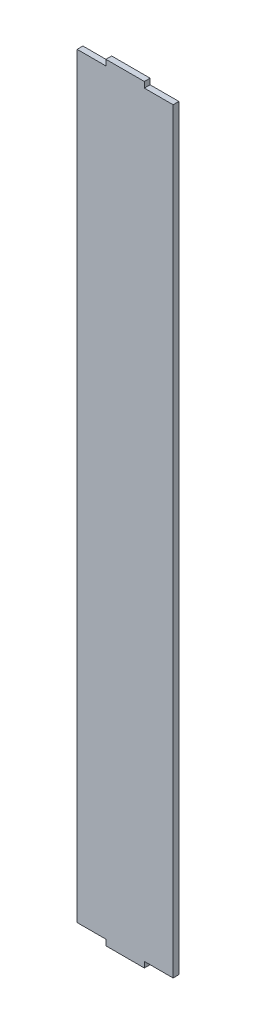
ISO-10303-21;
HEADER;
FILE_DESCRIPTION(('STEP AP214'),'2;1');
FILE_NAME('part.step','',(''),(''),'','','');
FILE_SCHEMA(('AUTOMOTIVE_DESIGN { 1 0 10303 214 1 1 1 1 }'));
ENDSEC;
DATA;
#1=APPLICATION_CONTEXT('core data for automotive mechanical design processes');
#2=APPLICATION_PROTOCOL_DEFINITION('international standard','automotive_design',2000,#1);
#3=PRODUCT_CONTEXT('',#1,'mechanical');
#4=PRODUCT('Part','Part','',(#3));
#5=PRODUCT_RELATED_PRODUCT_CATEGORY('part','',(#4));
#6=PRODUCT_DEFINITION_FORMATION('','',#4);
#7=PRODUCT_DEFINITION_CONTEXT('part definition',#1,'design');
#8=PRODUCT_DEFINITION('design','',#6,#7);
#9=PRODUCT_DEFINITION_SHAPE('','',#8);
#10=(LENGTH_UNIT() NAMED_UNIT(*) SI_UNIT(.MILLI.,.METRE.));
#11=(NAMED_UNIT(*) PLANE_ANGLE_UNIT() SI_UNIT($,.RADIAN.));
#12=(NAMED_UNIT(*) SI_UNIT($,.STERADIAN.) SOLID_ANGLE_UNIT());
#13=UNCERTAINTY_MEASURE_WITH_UNIT(LENGTH_MEASURE(1.E-05),#10,'distance_accuracy_value','');
#14=(GEOMETRIC_REPRESENTATION_CONTEXT(3) GLOBAL_UNCERTAINTY_ASSIGNED_CONTEXT((#13)) GLOBAL_UNIT_ASSIGNED_CONTEXT((#10,
#11,#12)) REPRESENTATION_CONTEXT('',''));
#15=CARTESIAN_POINT('',(0.,0.,0.));
#16=DIRECTION('',(0.,0.,1.));
#17=DIRECTION('',(1.,0.,0.));
#18=AXIS2_PLACEMENT_3D('',#15,#16,#17);
#19=CARTESIAN_POINT('',(35.,0.,3.));
#20=DIRECTION('',(-1.,0.,0.));
#21=DIRECTION('',(0.,0.,1.));
#22=AXIS2_PLACEMENT_3D('',#19,#20,#21);
#23=PLANE('',#22);
#24=DIRECTION('',(0.,1.,0.));
#25=VECTOR('',#24,1.);
#26=CARTESIAN_POINT('',(35.,0.,0.));
#27=LINE('',#26,#25);
#28=CARTESIAN_POINT('',(35.,-3.,0.));
#29=VERTEX_POINT('',#28);
#30=CARTESIAN_POINT('',(35.,0.,0.));
#31=VERTEX_POINT('',#30);
#32=EDGE_CURVE('E154',#29,#31,#27,.T.);
#33=ORIENTED_EDGE('',*,*,#32,.T.);
#34=DIRECTION('',(0.,0.,-1.));
#35=VECTOR('',#34,1.);
#36=CARTESIAN_POINT('',(35.,0.,3.));
#37=LINE('',#36,#35);
#38=CARTESIAN_POINT('',(35.,0.,3.));
#39=VERTEX_POINT('',#38);
#40=EDGE_CURVE('E11',#39,#31,#37,.T.);
#41=ORIENTED_EDGE('',*,*,#40,.F.);
#42=DIRECTION('',(0.,1.,0.));
#43=VECTOR('',#42,1.);
#44=CARTESIAN_POINT('',(35.,0.,3.));
#45=LINE('',#44,#43);
#46=CARTESIAN_POINT('',(35.,-3.,3.));
#47=VERTEX_POINT('',#46);
#48=EDGE_CURVE('E181',#47,#39,#45,.T.);
#49=ORIENTED_EDGE('',*,*,#48,.F.);
#50=DIRECTION('',(0.,0.,-1.));
#51=VECTOR('',#50,1.);
#52=CARTESIAN_POINT('',(35.,-3.,3.));
#53=LINE('',#52,#51);
#54=EDGE_CURVE('E150',#47,#29,#53,.T.);
#55=ORIENTED_EDGE('',*,*,#54,.T.);
#56=EDGE_LOOP('',(#33,#41,#49,#55));
#57=FACE_BOUND('',#56,.T.);
#58=ADVANCED_FACE('F33',(#57),#23,.F.);
#59=CARTESIAN_POINT('',(0.,0.,3.));
#60=DIRECTION('',(0.,1.,0.));
#61=DIRECTION('',(0.,0.,1.));
#62=AXIS2_PLACEMENT_3D('',#59,#60,#61);
#63=PLANE('',#62);
#64=DIRECTION('',(1.,0.,0.));
#65=VECTOR('',#64,1.);
#66=CARTESIAN_POINT('',(0.,0.,0.));
#67=LINE('',#66,#65);
#68=CARTESIAN_POINT('',(50.,0.,0.));
#69=VERTEX_POINT('',#68);
#70=EDGE_CURVE('E157',#31,#69,#67,.T.);
#71=ORIENTED_EDGE('',*,*,#70,.T.);
#72=DIRECTION('',(0.,0.,-1.));
#73=VECTOR('',#72,1.);
#74=CARTESIAN_POINT('',(50.,0.,3.));
#75=LINE('',#74,#73);
#76=CARTESIAN_POINT('',(50.,0.,3.));
#77=VERTEX_POINT('',#76);
#78=EDGE_CURVE('E41',#77,#69,#75,.T.);
#79=ORIENTED_EDGE('',*,*,#78,.F.);
#80=DIRECTION('',(1.,0.,0.));
#81=VECTOR('',#80,1.);
#82=CARTESIAN_POINT('',(0.,0.,3.));
#83=LINE('',#82,#81);
#84=EDGE_CURVE('E104',#39,#77,#83,.T.);
#85=ORIENTED_EDGE('',*,*,#84,.F.);
#86=ORIENTED_EDGE('',*,*,#40,.T.);
#87=EDGE_LOOP('',(#71,#79,#85,#86));
#88=FACE_BOUND('',#87,.T.);
#89=ADVANCED_FACE('F251',(#88),#63,.F.);
#90=CARTESIAN_POINT('',(50.,0.,3.));
#91=DIRECTION('',(-1.,0.,0.));
#92=DIRECTION('',(0.,-1.,0.));
#93=AXIS2_PLACEMENT_3D('',#90,#91,#92);
#94=PLANE('',#93);
#95=DIRECTION('',(0.,1.,0.));
#96=VECTOR('',#95,1.);
#97=CARTESIAN_POINT('',(50.,0.,0.));
#98=LINE('',#97,#96);
#99=CARTESIAN_POINT('',(50.,394.,0.));
#100=VERTEX_POINT('',#99);
#101=EDGE_CURVE('E159',#69,#100,#98,.T.);
#102=ORIENTED_EDGE('',*,*,#101,.T.);
#103=DIRECTION('',(0.,0.,-1.));
#104=VECTOR('',#103,1.);
#105=CARTESIAN_POINT('',(50.,394.,3.));
#106=LINE('',#105,#104);
#107=CARTESIAN_POINT('',(50.,394.,3.));
#108=VERTEX_POINT('',#107);
#109=EDGE_CURVE('E195',#108,#100,#106,.T.);
#110=ORIENTED_EDGE('',*,*,#109,.F.);
#111=DIRECTION('',(0.,1.,0.));
#112=VECTOR('',#111,1.);
#113=CARTESIAN_POINT('',(50.,0.,3.));
#114=LINE('',#113,#112);
#115=EDGE_CURVE('E203',#77,#108,#114,.T.);
#116=ORIENTED_EDGE('',*,*,#115,.F.);
#117=ORIENTED_EDGE('',*,*,#78,.T.);
#118=EDGE_LOOP('',(#102,#110,#116,#117));
#119=FACE_BOUND('',#118,.T.);
#120=ADVANCED_FACE('F201',(#119),#94,.F.);
#121=CARTESIAN_POINT('',(0.,394.,3.));
#122=DIRECTION('',(0.,-1.,0.));
#123=DIRECTION('',(0.,0.,-1.));
#124=AXIS2_PLACEMENT_3D('',#121,#122,#123);
#125=PLANE('',#124);
#126=DIRECTION('',(-1.,0.,0.));
#127=VECTOR('',#126,1.);
#128=CARTESIAN_POINT('',(0.,394.,0.));
#129=LINE('',#128,#127);
#130=CARTESIAN_POINT('',(35.,394.,0.));
#131=VERTEX_POINT('',#130);
#132=EDGE_CURVE('E161',#100,#131,#129,.T.);
#133=ORIENTED_EDGE('',*,*,#132,.T.);
#134=DIRECTION('',(0.,0.,-1.));
#135=VECTOR('',#134,1.);
#136=CARTESIAN_POINT('',(35.,394.,3.));
#137=LINE('',#136,#135);
#138=CARTESIAN_POINT('',(35.,394.,3.));
#139=VERTEX_POINT('',#138);
#140=EDGE_CURVE('E193',#139,#131,#137,.T.);
#141=ORIENTED_EDGE('',*,*,#140,.F.);
#142=DIRECTION('',(-1.,0.,0.));
#143=VECTOR('',#142,1.);
#144=CARTESIAN_POINT('',(0.,394.,3.));
#145=LINE('',#144,#143);
#146=EDGE_CURVE('E214',#108,#139,#145,.T.);
#147=ORIENTED_EDGE('',*,*,#146,.F.);
#148=ORIENTED_EDGE('',*,*,#109,.T.);
#149=EDGE_LOOP('',(#133,#141,#147,#148));
#150=FACE_BOUND('',#149,.T.);
#151=ADVANCED_FACE('F211',(#150),#125,.F.);
#152=CARTESIAN_POINT('',(35.,0.,3.));
#153=DIRECTION('',(1.,0.,0.));
#154=DIRECTION('',(0.,0.,-1.));
#155=AXIS2_PLACEMENT_3D('',#152,#153,#154);
#156=PLANE('',#155);
#157=DIRECTION('',(0.,-1.,0.));
#158=VECTOR('',#157,1.);
#159=CARTESIAN_POINT('',(35.,0.,0.));
#160=LINE('',#159,#158);
#161=CARTESIAN_POINT('',(35.,397.,0.));
#162=VERTEX_POINT('',#161);
#163=EDGE_CURVE('E164',#162,#131,#160,.T.);
#164=ORIENTED_EDGE('',*,*,#163,.F.);
#165=DIRECTION('',(0.,0.,-1.));
#166=VECTOR('',#165,1.);
#167=CARTESIAN_POINT('',(35.,397.,3.));
#168=LINE('',#167,#166);
#169=CARTESIAN_POINT('',(35.,397.,3.));
#170=VERTEX_POINT('',#169);
#171=EDGE_CURVE('E191',#170,#162,#168,.T.);
#172=ORIENTED_EDGE('',*,*,#171,.F.);
#173=DIRECTION('',(0.,-1.,0.));
#174=VECTOR('',#173,1.);
#175=CARTESIAN_POINT('',(35.,0.,3.));
#176=LINE('',#175,#174);
#177=EDGE_CURVE('E216',#170,#139,#176,.T.);
#178=ORIENTED_EDGE('',*,*,#177,.T.);
#179=ORIENTED_EDGE('',*,*,#140,.T.);
#180=EDGE_LOOP('',(#164,#172,#178,#179));
#181=FACE_BOUND('',#180,.T.);
#182=ADVANCED_FACE('F320',(#181),#156,.T.);
#183=CARTESIAN_POINT('',(0.,397.,3.));
#184=DIRECTION('',(0.,1.,0.));
#185=DIRECTION('',(0.,0.,1.));
#186=AXIS2_PLACEMENT_3D('',#183,#184,#185);
#187=PLANE('',#186);
#188=DIRECTION('',(1.,0.,0.));
#189=VECTOR('',#188,1.);
#190=CARTESIAN_POINT('',(0.,397.,0.));
#191=LINE('',#190,#189);
#192=CARTESIAN_POINT('',(15.,397.,0.));
#193=VERTEX_POINT('',#192);
#194=EDGE_CURVE('E167',#193,#162,#191,.T.);
#195=ORIENTED_EDGE('',*,*,#194,.F.);
#196=DIRECTION('',(0.,0.,-1.));
#197=VECTOR('',#196,1.);
#198=CARTESIAN_POINT('',(15.,397.,3.));
#199=LINE('',#198,#197);
#200=CARTESIAN_POINT('',(15.,397.,3.));
#201=VERTEX_POINT('',#200);
#202=EDGE_CURVE('E189',#201,#193,#199,.T.);
#203=ORIENTED_EDGE('',*,*,#202,.F.);
#204=DIRECTION('',(1.,0.,0.));
#205=VECTOR('',#204,1.);
#206=CARTESIAN_POINT('',(0.,397.,3.));
#207=LINE('',#206,#205);
#208=EDGE_CURVE('E218',#201,#170,#207,.T.);
#209=ORIENTED_EDGE('',*,*,#208,.T.);
#210=ORIENTED_EDGE('',*,*,#171,.T.);
#211=EDGE_LOOP('',(#195,#203,#209,#210));
#212=FACE_BOUND('',#211,.T.);
#213=ADVANCED_FACE('F311',(#212),#187,.T.);
#214=CARTESIAN_POINT('',(15.,0.,3.));
#215=DIRECTION('',(-1.,0.,0.));
#216=DIRECTION('',(0.,0.,1.));
#217=AXIS2_PLACEMENT_3D('',#214,#215,#216);
#218=PLANE('',#217);
#219=DIRECTION('',(0.,1.,0.));
#220=VECTOR('',#219,1.);
#221=CARTESIAN_POINT('',(15.,0.,0.));
#222=LINE('',#221,#220);
#223=CARTESIAN_POINT('',(15.,394.,0.));
#224=VERTEX_POINT('',#223);
#225=EDGE_CURVE('E170',#224,#193,#222,.T.);
#226=ORIENTED_EDGE('',*,*,#225,.F.);
#227=DIRECTION('',(0.,0.,-1.));
#228=VECTOR('',#227,1.);
#229=CARTESIAN_POINT('',(15.,394.,3.));
#230=LINE('',#229,#228);
#231=CARTESIAN_POINT('',(15.,394.,3.));
#232=VERTEX_POINT('',#231);
#233=EDGE_CURVE('E187',#232,#224,#230,.T.);
#234=ORIENTED_EDGE('',*,*,#233,.F.);
#235=DIRECTION('',(0.,1.,0.));
#236=VECTOR('',#235,1.);
#237=CARTESIAN_POINT('',(15.,0.,3.));
#238=LINE('',#237,#236);
#239=EDGE_CURVE('E225',#232,#201,#238,.T.);
#240=ORIENTED_EDGE('',*,*,#239,.T.);
#241=ORIENTED_EDGE('',*,*,#202,.T.);
#242=EDGE_LOOP('',(#226,#234,#240,#241));
#243=FACE_BOUND('',#242,.T.);
#244=ADVANCED_FACE('F237',(#243),#218,.T.);
#245=CARTESIAN_POINT('',(0.,394.,3.));
#246=DIRECTION('',(0.,1.,0.));
#247=DIRECTION('',(0.,0.,1.));
#248=AXIS2_PLACEMENT_3D('',#245,#246,#247);
#249=PLANE('',#248);
#250=DIRECTION('',(1.,0.,0.));
#251=VECTOR('',#250,1.);
#252=CARTESIAN_POINT('',(0.,394.,0.));
#253=LINE('',#252,#251);
#254=CARTESIAN_POINT('',(0.,394.,0.));
#255=VERTEX_POINT('',#254);
#256=EDGE_CURVE('E173',#255,#224,#253,.T.);
#257=ORIENTED_EDGE('',*,*,#256,.F.);
#258=DIRECTION('',(0.,0.,-1.));
#259=VECTOR('',#258,1.);
#260=CARTESIAN_POINT('',(0.,394.,3.));
#261=LINE('',#260,#259);
#262=CARTESIAN_POINT('',(0.,394.,3.));
#263=VERTEX_POINT('',#262);
#264=EDGE_CURVE('E185',#263,#255,#261,.T.);
#265=ORIENTED_EDGE('',*,*,#264,.F.);
#266=DIRECTION('',(1.,0.,0.));
#267=VECTOR('',#266,1.);
#268=CARTESIAN_POINT('',(0.,394.,3.));
#269=LINE('',#268,#267);
#270=EDGE_CURVE('E228',#263,#232,#269,.T.);
#271=ORIENTED_EDGE('',*,*,#270,.T.);
#272=ORIENTED_EDGE('',*,*,#233,.T.);
#273=EDGE_LOOP('',(#257,#265,#271,#272));
#274=FACE_BOUND('',#273,.T.);
#275=ADVANCED_FACE('F232',(#274),#249,.T.);
#276=CARTESIAN_POINT('',(0.,0.,3.));
#277=DIRECTION('',(1.,0.,0.));
#278=DIRECTION('',(0.,0.,-1.));
#279=AXIS2_PLACEMENT_3D('',#276,#277,#278);
#280=PLANE('',#279);
#281=DIRECTION('',(0.,-1.,0.));
#282=VECTOR('',#281,1.);
#283=CARTESIAN_POINT('',(0.,0.,0.));
#284=LINE('',#283,#282);
#285=CARTESIAN_POINT('',(0.,0.,0.));
#286=VERTEX_POINT('',#285);
#287=EDGE_CURVE('E176',#255,#286,#284,.T.);
#288=ORIENTED_EDGE('',*,*,#287,.T.);
#289=DIRECTION('',(0.,0.,-1.));
#290=VECTOR('',#289,1.);
#291=CARTESIAN_POINT('',(0.,0.,3.));
#292=LINE('',#291,#290);
#293=CARTESIAN_POINT('',(0.,0.,3.));
#294=VERTEX_POINT('',#293);
#295=EDGE_CURVE('E145',#294,#286,#292,.T.);
#296=ORIENTED_EDGE('',*,*,#295,.F.);
#297=DIRECTION('',(0.,-1.,0.));
#298=VECTOR('',#297,1.);
#299=CARTESIAN_POINT('',(0.,0.,3.));
#300=LINE('',#299,#298);
#301=EDGE_CURVE('E136',#263,#294,#300,.T.);
#302=ORIENTED_EDGE('',*,*,#301,.F.);
#303=ORIENTED_EDGE('',*,*,#264,.T.);
#304=EDGE_LOOP('',(#288,#296,#302,#303));
#305=FACE_BOUND('',#304,.T.);
#306=ADVANCED_FACE('F241',(#305),#280,.F.);
#307=CARTESIAN_POINT('',(0.,0.,3.));
#308=DIRECTION('',(0.,1.,0.));
#309=DIRECTION('',(0.,0.,1.));
#310=AXIS2_PLACEMENT_3D('',#307,#308,#309);
#311=PLANE('',#310);
#312=DIRECTION('',(1.,0.,0.));
#313=VECTOR('',#312,1.);
#314=CARTESIAN_POINT('',(0.,0.,0.));
#315=LINE('',#314,#313);
#316=CARTESIAN_POINT('',(15.,0.,0.));
#317=VERTEX_POINT('',#316);
#318=EDGE_CURVE('E144',#286,#317,#315,.T.);
#319=ORIENTED_EDGE('',*,*,#318,.T.);
#320=DIRECTION('',(0.,0.,-1.));
#321=VECTOR('',#320,1.);
#322=CARTESIAN_POINT('',(15.,0.,3.));
#323=LINE('',#322,#321);
#324=CARTESIAN_POINT('',(15.,0.,3.));
#325=VERTEX_POINT('',#324);
#326=EDGE_CURVE('E141',#325,#317,#323,.T.);
#327=ORIENTED_EDGE('',*,*,#326,.F.);
#328=DIRECTION('',(1.,0.,0.));
#329=VECTOR('',#328,1.);
#330=CARTESIAN_POINT('',(0.,0.,3.));
#331=LINE('',#330,#329);
#332=EDGE_CURVE('E129',#294,#325,#331,.T.);
#333=ORIENTED_EDGE('',*,*,#332,.F.);
#334=ORIENTED_EDGE('',*,*,#295,.T.);
#335=EDGE_LOOP('',(#319,#327,#333,#334));
#336=FACE_BOUND('',#335,.T.);
#337=ADVANCED_FACE('F142',(#336),#311,.F.);
#338=CARTESIAN_POINT('',(15.,0.,3.));
#339=DIRECTION('',(1.,0.,0.));
#340=DIRECTION('',(0.,0.,-1.));
#341=AXIS2_PLACEMENT_3D('',#338,#339,#340);
#342=PLANE('',#341);
#343=DIRECTION('',(0.,-1.,0.));
#344=VECTOR('',#343,1.);
#345=CARTESIAN_POINT('',(15.,0.,0.));
#346=LINE('',#345,#344);
#347=CARTESIAN_POINT('',(15.,-3.,0.));
#348=VERTEX_POINT('',#347);
#349=EDGE_CURVE('E90',#317,#348,#346,.T.);
#350=ORIENTED_EDGE('',*,*,#349,.T.);
#351=DIRECTION('',(0.,0.,-1.));
#352=VECTOR('',#351,1.);
#353=CARTESIAN_POINT('',(15.,-3.,3.));
#354=LINE('',#353,#352);
#355=CARTESIAN_POINT('',(15.,-3.,3.));
#356=VERTEX_POINT('',#355);
#357=EDGE_CURVE('E146',#356,#348,#354,.T.);
#358=ORIENTED_EDGE('',*,*,#357,.F.);
#359=DIRECTION('',(0.,-1.,0.));
#360=VECTOR('',#359,1.);
#361=CARTESIAN_POINT('',(15.,0.,3.));
#362=LINE('',#361,#360);
#363=EDGE_CURVE('E133',#325,#356,#362,.T.);
#364=ORIENTED_EDGE('',*,*,#363,.F.);
#365=ORIENTED_EDGE('',*,*,#326,.T.);
#366=EDGE_LOOP('',(#350,#358,#364,#365));
#367=FACE_BOUND('',#366,.T.);
#368=ADVANCED_FACE('F148',(#367),#342,.F.);
#369=CARTESIAN_POINT('',(0.,-3.,3.));
#370=DIRECTION('',(0.,1.,0.));
#371=DIRECTION('',(0.,0.,1.));
#372=AXIS2_PLACEMENT_3D('',#369,#370,#371);
#373=PLANE('',#372);
#374=DIRECTION('',(1.,0.,0.));
#375=VECTOR('',#374,1.);
#376=CARTESIAN_POINT('',(0.,-3.,0.));
#377=LINE('',#376,#375);
#378=EDGE_CURVE('E96',#348,#29,#377,.T.);
#379=ORIENTED_EDGE('',*,*,#378,.T.);
#380=ORIENTED_EDGE('',*,*,#54,.F.);
#381=DIRECTION('',(1.,0.,0.));
#382=VECTOR('',#381,1.);
#383=CARTESIAN_POINT('',(0.,-3.,3.));
#384=LINE('',#383,#382);
#385=EDGE_CURVE('E49',#356,#47,#384,.T.);
#386=ORIENTED_EDGE('',*,*,#385,.F.);
#387=ORIENTED_EDGE('',*,*,#357,.T.);
#388=EDGE_LOOP('',(#379,#380,#386,#387));
#389=FACE_BOUND('',#388,.T.);
#390=ADVANCED_FACE('F258',(#389),#373,.F.);
#391=CARTESIAN_POINT('',(0.,0.,3.));
#392=DIRECTION('',(0.,0.,1.));
#393=DIRECTION('',(1.,0.,0.));
#394=AXIS2_PLACEMENT_3D('',#391,#392,#393);
#395=PLANE('',#394);
#396=ORIENTED_EDGE('',*,*,#48,.T.);
#397=ORIENTED_EDGE('',*,*,#84,.T.);
#398=ORIENTED_EDGE('',*,*,#115,.T.);
#399=ORIENTED_EDGE('',*,*,#146,.T.);
#400=ORIENTED_EDGE('',*,*,#177,.F.);
#401=ORIENTED_EDGE('',*,*,#208,.F.);
#402=ORIENTED_EDGE('',*,*,#239,.F.);
#403=ORIENTED_EDGE('',*,*,#270,.F.);
#404=ORIENTED_EDGE('',*,*,#301,.T.);
#405=ORIENTED_EDGE('',*,*,#332,.T.);
#406=ORIENTED_EDGE('',*,*,#363,.T.);
#407=ORIENTED_EDGE('',*,*,#385,.T.);
#408=EDGE_LOOP('',(#396,#397,#398,#399,#400,#401,#402,#403,#404,#405,#406,#407));
#409=FACE_BOUND('',#408,.T.);
#410=ADVANCED_FACE('F131',(#409),#395,.T.);
#411=CARTESIAN_POINT('',(0.,0.,0.));
#412=DIRECTION('',(0.,0.,1.));
#413=DIRECTION('',(1.,0.,0.));
#414=AXIS2_PLACEMENT_3D('',#411,#412,#413);
#415=PLANE('',#414);
#416=ORIENTED_EDGE('',*,*,#32,.F.);
#417=ORIENTED_EDGE('',*,*,#378,.F.);
#418=ORIENTED_EDGE('',*,*,#349,.F.);
#419=ORIENTED_EDGE('',*,*,#318,.F.);
#420=ORIENTED_EDGE('',*,*,#287,.F.);
#421=ORIENTED_EDGE('',*,*,#256,.T.);
#422=ORIENTED_EDGE('',*,*,#225,.T.);
#423=ORIENTED_EDGE('',*,*,#194,.T.);
#424=ORIENTED_EDGE('',*,*,#163,.T.);
#425=ORIENTED_EDGE('',*,*,#132,.F.);
#426=ORIENTED_EDGE('',*,*,#101,.F.);
#427=ORIENTED_EDGE('',*,*,#70,.F.);
#428=EDGE_LOOP('',(#416,#417,#418,#419,#420,#421,#422,#423,#424,#425,#426,#427));
#429=FACE_BOUND('',#428,.T.);
#430=ADVANCED_FACE('F207',(#429),#415,.F.);
#431=CLOSED_SHELL('',(#58,#89,#120,#151,#182,#213,#244,#275,#306,#337,#368,#390,#410,#430));
#432=MANIFOLD_SOLID_BREP('B2',#431);
#433=ADVANCED_BREP_SHAPE_REPRESENTATION('',(#18,#432),#14);
#434=SHAPE_DEFINITION_REPRESENTATION(#9,#433);
ENDSEC;
END-ISO-10303-21;
